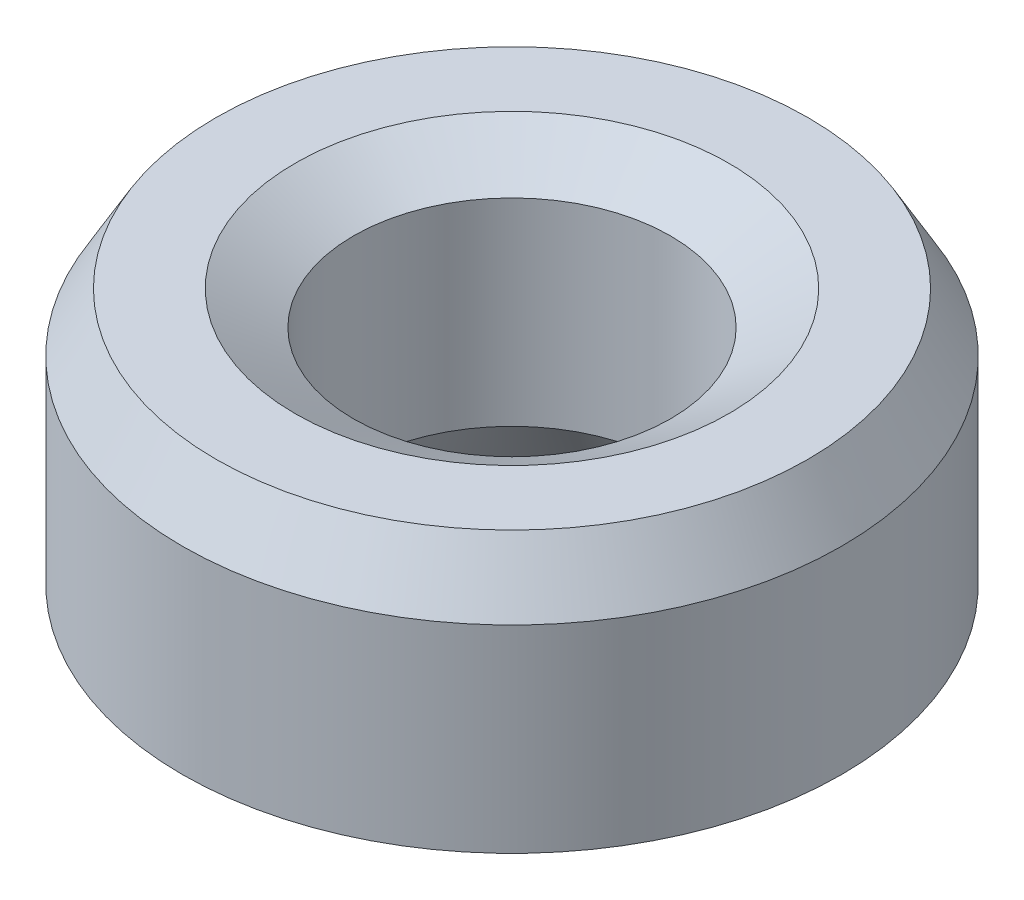
ISO-10303-21;
HEADER;
FILE_DESCRIPTION(('STEP AP214'),'2;1');
FILE_NAME('part.step','',(''),(''),'','','');
FILE_SCHEMA(('AUTOMOTIVE_DESIGN { 1 0 10303 214 1 1 1 1 }'));
ENDSEC;
DATA;
#1=APPLICATION_CONTEXT('core data for automotive mechanical design processes');
#2=APPLICATION_PROTOCOL_DEFINITION('international standard','automotive_design',2000,#1);
#3=PRODUCT_CONTEXT('',#1,'mechanical');
#4=PRODUCT('Part','Part','',(#3));
#5=PRODUCT_RELATED_PRODUCT_CATEGORY('part','',(#4));
#6=PRODUCT_DEFINITION_FORMATION('','',#4);
#7=PRODUCT_DEFINITION_CONTEXT('part definition',#1,'design');
#8=PRODUCT_DEFINITION('design','',#6,#7);
#9=PRODUCT_DEFINITION_SHAPE('','',#8);
#10=(LENGTH_UNIT() NAMED_UNIT(*) SI_UNIT(.MILLI.,.METRE.));
#11=(NAMED_UNIT(*) PLANE_ANGLE_UNIT() SI_UNIT($,.RADIAN.));
#12=(NAMED_UNIT(*) SI_UNIT($,.STERADIAN.) SOLID_ANGLE_UNIT());
#13=UNCERTAINTY_MEASURE_WITH_UNIT(LENGTH_MEASURE(1.E-05),#10,'distance_accuracy_value','');
#14=(GEOMETRIC_REPRESENTATION_CONTEXT(3) GLOBAL_UNCERTAINTY_ASSIGNED_CONTEXT((#13)) GLOBAL_UNIT_ASSIGNED_CONTEXT((#10,
#11,#12)) REPRESENTATION_CONTEXT('',''));
#15=CARTESIAN_POINT('',(0.,0.,0.));
#16=DIRECTION('',(0.,0.,1.));
#17=DIRECTION('',(1.,0.,0.));
#18=AXIS2_PLACEMENT_3D('',#15,#16,#17);
#19=CARTESIAN_POINT('',(0.,6.59377787159426,0.));
#20=DIRECTION('',(0.,-1.,0.));
#21=DIRECTION('',(0.,0.,-1.));
#22=AXIS2_PLACEMENT_3D('',#19,#20,#21);
#23=CYLINDRICAL_SURFACE('',#22,7.5);
#24=CARTESIAN_POINT('',(0.,0.766874577956577,0.));
#25=DIRECTION('',(0.,1.,0.));
#26=DIRECTION('',(0.,0.,1.));
#27=AXIS2_PLACEMENT_3D('',#24,#25,#26);
#28=CIRCLE('',#27,7.5);
#29=CARTESIAN_POINT('',(0.,0.766874577956577,-7.5));
#30=VERTEX_POINT('',#29);
#31=EDGE_CURVE('E10',#30,#30,#28,.T.);
#32=CARTESIAN_POINT('',(0.,5.26551213954055,0.));
#33=DIRECTION('',(0.,1.,0.));
#34=DIRECTION('',(0.,0.,1.));
#35=AXIS2_PLACEMENT_3D('',#32,#33,#34);
#36=CIRCLE('',#35,7.5);
#37=CARTESIAN_POINT('',(0.,5.26551213954055,-7.5));
#38=VERTEX_POINT('',#37);
#39=EDGE_CURVE('E50',#38,#38,#36,.F.);
#40=CARTESIAN_POINT('',(0.,0.766874577956577,-7.5));
#41=CARTESIAN_POINT('',(0.,0.813735385889744,-7.5));
#42=CARTESIAN_POINT('',(0.,0.86059619382291,-7.5));
#43=CARTESIAN_POINT('',(0.,0.954317809689243,-7.5));
#44=CARTESIAN_POINT('',(0.,1.00117861762241,-7.5));
#45=CARTESIAN_POINT('',(0.,1.09490023348874,-7.5));
#46=CARTESIAN_POINT('',(0.,1.14176104142191,-7.5));
#47=CARTESIAN_POINT('',(0.,1.23548265728824,-7.5));
#48=CARTESIAN_POINT('',(0.,1.28234346522141,-7.5));
#49=CARTESIAN_POINT('',(0.,1.37606508108774,-7.5));
#50=CARTESIAN_POINT('',(0.,1.42292588902091,-7.5));
#51=CARTESIAN_POINT('',(0.,1.51664750488724,-7.5));
#52=CARTESIAN_POINT('',(0.,1.56350831282041,-7.5));
#53=CARTESIAN_POINT('',(0.,1.65722992868674,-7.5));
#54=CARTESIAN_POINT('',(0.,1.70409073661991,-7.5));
#55=CARTESIAN_POINT('',(0.,1.79781235248624,-7.5));
#56=CARTESIAN_POINT('',(0.,1.8446731604194,-7.5));
#57=CARTESIAN_POINT('',(0.,1.93839477628574,-7.5));
#58=CARTESIAN_POINT('',(0.,1.9852555842189,-7.5));
#59=CARTESIAN_POINT('',(0.,2.07897720008524,-7.5));
#60=CARTESIAN_POINT('',(0.,2.1258380080184,-7.5));
#61=CARTESIAN_POINT('',(0.,2.21955962388474,-7.5));
#62=CARTESIAN_POINT('',(0.,2.2664204318179,-7.5));
#63=CARTESIAN_POINT('',(0.,2.36014204768424,-7.5));
#64=CARTESIAN_POINT('',(0.,2.4070028556174,-7.5));
#65=CARTESIAN_POINT('',(0.,2.50072447148373,-7.5));
#66=CARTESIAN_POINT('',(0.,2.5475852794169,-7.5));
#67=CARTESIAN_POINT('',(0.,2.64130689528323,-7.5));
#68=CARTESIAN_POINT('',(0.,2.6881677032164,-7.5));
#69=CARTESIAN_POINT('',(0.,2.78188931908273,-7.5));
#70=CARTESIAN_POINT('',(0.,2.8287501270159,-7.5));
#71=CARTESIAN_POINT('',(0.,2.92247174288223,-7.5));
#72=CARTESIAN_POINT('',(0.,2.9693325508154,-7.5));
#73=CARTESIAN_POINT('',(0.,3.06305416668173,-7.5));
#74=CARTESIAN_POINT('',(0.,3.1099149746149,-7.5));
#75=CARTESIAN_POINT('',(0.,3.20363659048123,-7.5));
#76=CARTESIAN_POINT('',(0.,3.2504973984144,-7.5));
#77=CARTESIAN_POINT('',(0.,3.34421901428073,-7.5));
#78=CARTESIAN_POINT('',(0.,3.3910798222139,-7.5));
#79=CARTESIAN_POINT('',(0.,3.48480143808023,-7.5));
#80=CARTESIAN_POINT('',(0.,3.5316622460134,-7.5));
#81=CARTESIAN_POINT('',(0.,3.62538386187973,-7.5));
#82=CARTESIAN_POINT('',(0.,3.67224466981289,-7.5));
#83=CARTESIAN_POINT('',(0.,3.76596628567923,-7.5));
#84=CARTESIAN_POINT('',(0.,3.81282709361239,-7.5));
#85=CARTESIAN_POINT('',(0.,3.90654870947873,-7.5));
#86=CARTESIAN_POINT('',(0.,3.95340951741189,-7.5));
#87=CARTESIAN_POINT('',(0.,4.04713113327823,-7.5));
#88=CARTESIAN_POINT('',(0.,4.09399194121139,-7.5));
#89=CARTESIAN_POINT('',(0.,4.18771355707772,-7.5));
#90=CARTESIAN_POINT('',(0.,4.23457436501089,-7.5));
#91=CARTESIAN_POINT('',(0.,4.32829598087722,-7.5));
#92=CARTESIAN_POINT('',(0.,4.37515678881039,-7.5));
#93=CARTESIAN_POINT('',(0.,4.46887840467672,-7.5));
#94=CARTESIAN_POINT('',(0.,4.51573921260989,-7.5));
#95=CARTESIAN_POINT('',(0.,4.60946082847622,-7.5));
#96=CARTESIAN_POINT('',(0.,4.65632163640939,-7.5));
#97=CARTESIAN_POINT('',(0.,4.75004325227572,-7.5));
#98=CARTESIAN_POINT('',(0.,4.79690406020889,-7.5));
#99=CARTESIAN_POINT('',(0.,4.89062567607522,-7.5));
#100=CARTESIAN_POINT('',(0.,4.93748648400839,-7.5));
#101=CARTESIAN_POINT('',(0.,5.03120809987472,-7.5));
#102=CARTESIAN_POINT('',(0.,5.07806890780789,-7.5));
#103=CARTESIAN_POINT('',(0.,5.17179052367422,-7.5));
#104=CARTESIAN_POINT('',(0.,5.21865133160739,-7.5));
#105=CARTESIAN_POINT('',(0.,5.26551213954055,-7.5));
#106=B_SPLINE_CURVE_WITH_KNOTS('',3,(#40,#41,#42,#43,#44,#45,#46,#47,#48,#49,#50,#51,#52,#53,
#54,#55,#56,#57,#58,#59,#60,#61,#62,#63,#64,#65,#66,#67,#68,#69,#70,#71,#72,#73,#74,#75,#76,#77,
#78,#79,#80,#81,#82,#83,#84,#85,#86,#87,#88,#89,#90,#91,#92,#93,#94,#95,#96,#97,#98,#99,#100,
#101,#102,#103,#104,#105),.UNSPECIFIED.,.F.,.F.,(4,2,2,2,2,2,2,2,2,2,2,2,2,2,2,2,2,2,2,2,2,2,2,
2,2,2,2,2,2,2,2,2,4),(0.,0.140582423799499,0.281164847598998,0.421747271398498,
0.562329695197997,0.702912118997496,0.843494542796995,0.984076966596494,1.12465939039599,
1.26524181419549,1.40582423799499,1.54640666179449,1.68698908559399,1.82757150939349,
1.96815393319299,2.10873635699249,2.24931878079199,2.38990120459149,2.53048362839099,
2.67106605219048,2.81164847598998,2.95223089978948,3.09281332358898,3.23339574738848,
3.37397817118798,3.51456059498748,3.65514301878698,3.79572544258648,3.93630786638598,
4.07689029018548,4.21747271398498,4.35805513778448,4.49863756158397),.UNSPECIFIED.);
#107=EDGE_CURVE('BSEAM39',#30,#38,#106,.T.);
#108=ORIENTED_EDGE('',*,*,#31,.T.);
#109=ORIENTED_EDGE('',*,*,#39,.T.);
#110=ORIENTED_EDGE('',*,*,#107,.T.);
#111=ORIENTED_EDGE('',*,*,#107,.F.);
#112=EDGE_LOOP('',(#108,#110,#109,#111));
#113=FACE_BOUND('',#112,.T.);
#114=ADVANCED_FACE('F39',(#113),#23,.T.);
#115=CARTESIAN_POINT('',(0.,6.59377787159426,0.));
#116=DIRECTION('',(0.,1.,0.));
#117=DIRECTION('',(0.,0.,1.));
#118=AXIS2_PLACEMENT_3D('',#115,#116,#117);
#119=PLANE('',#118);
#120=CARTESIAN_POINT('',(0.,6.59377787159426,0.));
#121=DIRECTION('',(0.,1.,0.));
#122=DIRECTION('',(0.,0.,1.));
#123=AXIS2_PLACEMENT_3D('',#120,#121,#122);
#124=CIRCLE('',#123,4.93417433361481);
#125=CARTESIAN_POINT('',(0.,6.59377787159426,4.93417433361481));
#126=VERTEX_POINT('',#125);
#127=EDGE_CURVE('E58',#126,#126,#124,.F.);
#128=ORIENTED_EDGE('',*,*,#127,.T.);
#129=EDGE_LOOP('',(#128));
#130=FACE_BOUND('',#129,.T.);
#131=CARTESIAN_POINT('',(0.,6.59377787159426,0.));
#132=DIRECTION('',(0.,1.,0.));
#133=DIRECTION('',(0.,0.,1.));
#134=AXIS2_PLACEMENT_3D('',#131,#132,#133);
#135=CIRCLE('',#134,6.73312542204344);
#136=CARTESIAN_POINT('',(0.,6.59377787159426,6.73312542204344));
#137=VERTEX_POINT('',#136);
#138=EDGE_CURVE('E61',#137,#137,#135,.T.);
#139=ORIENTED_EDGE('',*,*,#138,.T.);
#140=EDGE_LOOP('',(#139));
#141=FACE_BOUND('',#140,.T.);
#142=ADVANCED_FACE('F88',(#130,#141),#119,.T.);
#143=CARTESIAN_POINT('',(0.,0.,0.));
#144=DIRECTION('',(0.,1.,0.));
#145=DIRECTION('',(0.,0.,1.));
#146=AXIS2_PLACEMENT_3D('',#143,#144,#145);
#147=PLANE('',#146);
#148=CARTESIAN_POINT('',(0.,0.,0.));
#149=DIRECTION('',(0.,1.,0.));
#150=DIRECTION('',(0.,0.,1.));
#151=AXIS2_PLACEMENT_3D('',#148,#149,#150);
#152=CIRCLE('',#151,4.37278317951763);
#153=CARTESIAN_POINT('',(0.,0.,4.37278317951763));
#154=VERTEX_POINT('',#153);
#155=EDGE_CURVE('E51',#154,#154,#152,.T.);
#156=ORIENTED_EDGE('',*,*,#155,.T.);
#157=EDGE_LOOP('',(#156));
#158=FACE_BOUND('',#157,.T.);
#159=CARTESIAN_POINT('',(0.,0.,0.));
#160=DIRECTION('',(0.,1.,0.));
#161=DIRECTION('',(0.,0.,1.));
#162=AXIS2_PLACEMENT_3D('',#159,#160,#161);
#163=CIRCLE('',#162,6.17173426794626);
#164=CARTESIAN_POINT('',(0.,0.,6.17173426794626));
#165=VERTEX_POINT('',#164);
#166=EDGE_CURVE('E54',#165,#165,#163,.F.);
#167=ORIENTED_EDGE('',*,*,#166,.T.);
#168=EDGE_LOOP('',(#167));
#169=FACE_BOUND('',#168,.T.);
#170=ADVANCED_FACE('F83',(#158,#169),#147,.F.);
#171=CARTESIAN_POINT('',(0.,6.59377787159426,0.));
#172=DIRECTION('',(0.,-1.,0.));
#173=DIRECTION('',(0.,0.,-1.));
#174=AXIS2_PLACEMENT_3D('',#171,#172,#173);
#175=CYLINDRICAL_SURFACE('',#174,3.60590860156108);
#176=CARTESIAN_POINT('',(0.,5.82690329363769,0.));
#177=DIRECTION('',(0.,1.,0.));
#178=DIRECTION('',(0.,0.,1.));
#179=AXIS2_PLACEMENT_3D('',#176,#177,#178);
#180=CIRCLE('',#179,3.60590860156108);
#181=CARTESIAN_POINT('',(0.,5.82690329363769,-3.60590860156108));
#182=VERTEX_POINT('',#181);
#183=EDGE_CURVE('E67',#182,#182,#180,.T.);
#184=CARTESIAN_POINT('',(0.,1.32826573205371,0.));
#185=DIRECTION('',(0.,1.,0.));
#186=DIRECTION('',(0.,0.,1.));
#187=AXIS2_PLACEMENT_3D('',#184,#185,#186);
#188=CIRCLE('',#187,3.60590860156108);
#189=CARTESIAN_POINT('',(0.,1.32826573205371,-3.60590860156108));
#190=VERTEX_POINT('',#189);
#191=EDGE_CURVE('E69',#190,#190,#188,.F.);
#192=CARTESIAN_POINT('',(0.,5.82690329363769,-3.60590860156108));
#193=CARTESIAN_POINT('',(0.,5.78004248570452,-3.60590860156108));
#194=CARTESIAN_POINT('',(0.,5.73318167777135,-3.60590860156108));
#195=CARTESIAN_POINT('',(0.,5.63946006190502,-3.60590860156108));
#196=CARTESIAN_POINT('',(0.,5.59259925397185,-3.60590860156108));
#197=CARTESIAN_POINT('',(0.,5.49887763810552,-3.60590860156108));
#198=CARTESIAN_POINT('',(0.,5.45201683017235,-3.60590860156108));
#199=CARTESIAN_POINT('',(0.,5.35829521430602,-3.60590860156108));
#200=CARTESIAN_POINT('',(0.,5.31143440637285,-3.60590860156108));
#201=CARTESIAN_POINT('',(0.,5.21771279050652,-3.60590860156108));
#202=CARTESIAN_POINT('',(0.,5.17085198257336,-3.60590860156108));
#203=CARTESIAN_POINT('',(0.,5.07713036670702,-3.60590860156108));
#204=CARTESIAN_POINT('',(0.,5.03026955877386,-3.60590860156108));
#205=CARTESIAN_POINT('',(0.,4.93654794290752,-3.60590860156108));
#206=CARTESIAN_POINT('',(0.,4.88968713497436,-3.60590860156108));
#207=CARTESIAN_POINT('',(0.,4.79596551910802,-3.60590860156108));
#208=CARTESIAN_POINT('',(0.,4.74910471117486,-3.60590860156108));
#209=CARTESIAN_POINT('',(0.,4.65538309530853,-3.60590860156108));
#210=CARTESIAN_POINT('',(0.,4.60852228737536,-3.60590860156108));
#211=CARTESIAN_POINT('',(0.,4.51480067150903,-3.60590860156108));
#212=CARTESIAN_POINT('',(0.,4.46793986357586,-3.60590860156108));
#213=CARTESIAN_POINT('',(0.,4.37421824770953,-3.60590860156108));
#214=CARTESIAN_POINT('',(0.,4.32735743977636,-3.60590860156108));
#215=CARTESIAN_POINT('',(0.,4.23363582391003,-3.60590860156108));
#216=CARTESIAN_POINT('',(0.,4.18677501597686,-3.60590860156108));
#217=CARTESIAN_POINT('',(0.,4.09305340011053,-3.60590860156108));
#218=CARTESIAN_POINT('',(0.,4.04619259217736,-3.60590860156108));
#219=CARTESIAN_POINT('',(0.,3.95247097631103,-3.60590860156108));
#220=CARTESIAN_POINT('',(0.,3.90561016837786,-3.60590860156108));
#221=CARTESIAN_POINT('',(0.,3.81188855251153,-3.60590860156108));
#222=CARTESIAN_POINT('',(0.,3.76502774457836,-3.60590860156108));
#223=CARTESIAN_POINT('',(0.,3.67130612871203,-3.60590860156108));
#224=CARTESIAN_POINT('',(0.,3.62444532077886,-3.60590860156108));
#225=CARTESIAN_POINT('',(0.,3.53072370491253,-3.60590860156108));
#226=CARTESIAN_POINT('',(0.,3.48386289697937,-3.60590860156108));
#227=CARTESIAN_POINT('',(0.,3.39014128111303,-3.60590860156108));
#228=CARTESIAN_POINT('',(0.,3.34328047317987,-3.60590860156108));
#229=CARTESIAN_POINT('',(0.,3.24955885731353,-3.60590860156108));
#230=CARTESIAN_POINT('',(0.,3.20269804938037,-3.60590860156108));
#231=CARTESIAN_POINT('',(0.,3.10897643351403,-3.60590860156108));
#232=CARTESIAN_POINT('',(0.,3.06211562558087,-3.60590860156108));
#233=CARTESIAN_POINT('',(0.,2.96839400971453,-3.60590860156108));
#234=CARTESIAN_POINT('',(0.,2.92153320178137,-3.60590860156108));
#235=CARTESIAN_POINT('',(0.,2.82781158591504,-3.60590860156108));
#236=CARTESIAN_POINT('',(0.,2.78095077798187,-3.60590860156108));
#237=CARTESIAN_POINT('',(0.,2.68722916211554,-3.60590860156108));
#238=CARTESIAN_POINT('',(0.,2.64036835418237,-3.60590860156108));
#239=CARTESIAN_POINT('',(0.,2.54664673831604,-3.60590860156108));
#240=CARTESIAN_POINT('',(0.,2.49978593038287,-3.60590860156108));
#241=CARTESIAN_POINT('',(0.,2.40606431451654,-3.60590860156108));
#242=CARTESIAN_POINT('',(0.,2.35920350658337,-3.60590860156108));
#243=CARTESIAN_POINT('',(0.,2.26548189071704,-3.60590860156108));
#244=CARTESIAN_POINT('',(0.,2.21862108278387,-3.60590860156108));
#245=CARTESIAN_POINT('',(0.,2.12489946691754,-3.60590860156108));
#246=CARTESIAN_POINT('',(0.,2.07803865898437,-3.60590860156108));
#247=CARTESIAN_POINT('',(0.,1.98431704311804,-3.60590860156108));
#248=CARTESIAN_POINT('',(0.,1.93745623518487,-3.60590860156108));
#249=CARTESIAN_POINT('',(0.,1.84373461931854,-3.60590860156108));
#250=CARTESIAN_POINT('',(0.,1.79687381138538,-3.60590860156108));
#251=CARTESIAN_POINT('',(0.,1.70315219551904,-3.60590860156108));
#252=CARTESIAN_POINT('',(0.,1.65629138758588,-3.60590860156108));
#253=CARTESIAN_POINT('',(0.,1.56256977171954,-3.60590860156108));
#254=CARTESIAN_POINT('',(0.,1.51570896378638,-3.60590860156108));
#255=CARTESIAN_POINT('',(0.,1.42198734792004,-3.60590860156108));
#256=CARTESIAN_POINT('',(0.,1.37512653998688,-3.60590860156108));
#257=CARTESIAN_POINT('',(0.,1.32826573205371,-3.60590860156108));
#258=B_SPLINE_CURVE_WITH_KNOTS('',3,(#192,#193,#194,#195,#196,#197,#198,#199,#200,#201,#202,
#203,#204,#205,#206,#207,#208,#209,#210,#211,#212,#213,#214,#215,#216,#217,#218,#219,#220,#221,
#222,#223,#224,#225,#226,#227,#228,#229,#230,#231,#232,#233,#234,#235,#236,#237,#238,#239,#240,
#241,#242,#243,#244,#245,#246,#247,#248,#249,#250,#251,#252,#253,#254,#255,#256,#257),
.UNSPECIFIED.,.F.,.F.,(4,2,2,2,2,2,2,2,2,2,2,2,2,2,2,2,2,2,2,2,2,2,2,2,2,2,2,2,2,2,2,2,4),(0.,
0.140582423799499,0.281164847598998,0.421747271398498,0.562329695197998,0.702912118997497,
0.843494542796996,0.984076966596495,1.12465939039599,1.26524181419549,1.40582423799499,
1.54640666179449,1.68698908559399,1.82757150939349,1.96815393319299,2.10873635699249,
2.24931878079199,2.38990120459149,2.53048362839099,2.67106605219048,2.81164847598998,
2.95223089978948,3.09281332358898,3.23339574738848,3.37397817118798,3.51456059498748,
3.65514301878698,3.79572544258648,3.93630786638598,4.07689029018548,4.21747271398498,
4.35805513778448,4.49863756158397),.UNSPECIFIED.);
#259=EDGE_CURVE('BSEAM71',#182,#190,#258,.T.);
#260=ORIENTED_EDGE('',*,*,#183,.T.);
#261=ORIENTED_EDGE('',*,*,#191,.T.);
#262=ORIENTED_EDGE('',*,*,#259,.T.);
#263=ORIENTED_EDGE('',*,*,#259,.F.);
#264=EDGE_LOOP('',(#260,#262,#261,#263));
#265=FACE_BOUND('',#264,.T.);
#266=ADVANCED_FACE('F71',(#265),#175,.F.);
#267=CARTESIAN_POINT('',(0.,5.82690329363769,0.));
#268=DIRECTION('',(0.,1.,0.));
#269=DIRECTION('',(0.,0.,1.));
#270=AXIS2_PLACEMENT_3D('',#267,#268,#269);
#271=CONICAL_SURFACE('',#270,3.60590860156108,1.0471975511966);
#272=ORIENTED_EDGE('',*,*,#127,.F.);
#273=EDGE_LOOP('',(#272));
#274=FACE_BOUND('',#273,.T.);
#275=ORIENTED_EDGE('',*,*,#183,.F.);
#276=EDGE_LOOP('',(#275));
#277=FACE_BOUND('',#276,.T.);
#278=ADVANCED_FACE('F77',(#274,#277),#271,.F.);
#279=CARTESIAN_POINT('',(0.,0.,0.));
#280=DIRECTION('',(0.,-1.,0.));
#281=DIRECTION('',(0.,0.,-1.));
#282=AXIS2_PLACEMENT_3D('',#279,#280,#281);
#283=CONICAL_SURFACE('',#282,4.37278317951763,0.523598775598294);
#284=ORIENTED_EDGE('',*,*,#191,.F.);
#285=EDGE_LOOP('',(#284));
#286=FACE_BOUND('',#285,.T.);
#287=ORIENTED_EDGE('',*,*,#155,.F.);
#288=EDGE_LOOP('',(#287));
#289=FACE_BOUND('',#288,.T.);
#290=ADVANCED_FACE('F73',(#286,#289),#283,.F.);
#291=CARTESIAN_POINT('',(0.,0.766874577956577,0.));
#292=DIRECTION('',(0.,1.,0.));
#293=DIRECTION('',(0.,0.,1.));
#294=AXIS2_PLACEMENT_3D('',#291,#292,#293);
#295=CONICAL_SURFACE('',#294,7.5,1.0471975511966);
#296=ORIENTED_EDGE('',*,*,#166,.F.);
#297=EDGE_LOOP('',(#296));
#298=FACE_BOUND('',#297,.T.);
#299=ORIENTED_EDGE('',*,*,#31,.F.);
#300=EDGE_LOOP('',(#299));
#301=FACE_BOUND('',#300,.T.);
#302=ADVANCED_FACE('F76',(#298,#301),#295,.T.);
#303=CARTESIAN_POINT('',(0.,6.59377787159426,0.));
#304=DIRECTION('',(0.,-1.,0.));
#305=DIRECTION('',(0.,0.,-1.));
#306=AXIS2_PLACEMENT_3D('',#303,#304,#305);
#307=CONICAL_SURFACE('',#306,6.73312542204344,0.523598775598295);
#308=ORIENTED_EDGE('',*,*,#39,.F.);
#309=EDGE_LOOP('',(#308));
#310=FACE_BOUND('',#309,.T.);
#311=ORIENTED_EDGE('',*,*,#138,.F.);
#312=EDGE_LOOP('',(#311));
#313=FACE_BOUND('',#312,.T.);
#314=ADVANCED_FACE('F45',(#310,#313),#307,.T.);
#315=CLOSED_SHELL('',(#114,#142,#170,#266,#278,#290,#302,#314));
#316=MANIFOLD_SOLID_BREP('B2',#315);
#317=ADVANCED_BREP_SHAPE_REPRESENTATION('',(#18,#316),#14);
#318=SHAPE_DEFINITION_REPRESENTATION(#9,#317);
ENDSEC;
END-ISO-10303-21;
